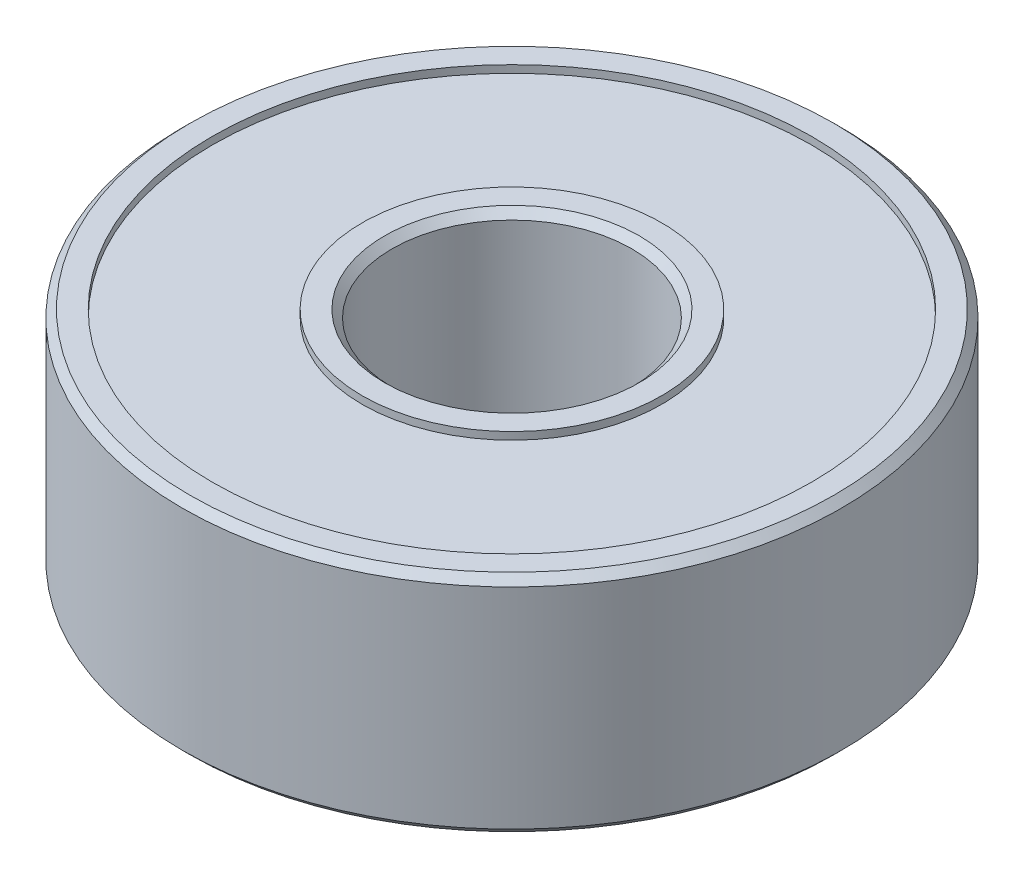
ISO-10303-21;
HEADER;
FILE_DESCRIPTION(('STEP AP214'),'2;1');
FILE_NAME('part.step','',(''),(''),'','','');
FILE_SCHEMA(('AUTOMOTIVE_DESIGN { 1 0 10303 214 1 1 1 1 }'));
ENDSEC;
DATA;
#1=APPLICATION_CONTEXT('core data for automotive mechanical design processes');
#2=APPLICATION_PROTOCOL_DEFINITION('international standard','automotive_design',2000,#1);
#3=PRODUCT_CONTEXT('',#1,'mechanical');
#4=PRODUCT('Part','Part','',(#3));
#5=PRODUCT_RELATED_PRODUCT_CATEGORY('part','',(#4));
#6=PRODUCT_DEFINITION_FORMATION('','',#4);
#7=PRODUCT_DEFINITION_CONTEXT('part definition',#1,'design');
#8=PRODUCT_DEFINITION('design','',#6,#7);
#9=PRODUCT_DEFINITION_SHAPE('','',#8);
#10=(LENGTH_UNIT() NAMED_UNIT(*) SI_UNIT(.MILLI.,.METRE.));
#11=(NAMED_UNIT(*) PLANE_ANGLE_UNIT() SI_UNIT($,.RADIAN.));
#12=(NAMED_UNIT(*) SI_UNIT($,.STERADIAN.) SOLID_ANGLE_UNIT());
#13=UNCERTAINTY_MEASURE_WITH_UNIT(LENGTH_MEASURE(1.E-05),#10,'distance_accuracy_value','');
#14=(GEOMETRIC_REPRESENTATION_CONTEXT(3) GLOBAL_UNCERTAINTY_ASSIGNED_CONTEXT((#13)) GLOBAL_UNIT_ASSIGNED_CONTEXT((#10,
#11,#12)) REPRESENTATION_CONTEXT('',''));
#15=CARTESIAN_POINT('',(0.,0.,0.));
#16=DIRECTION('',(0.,0.,1.));
#17=DIRECTION('',(1.,0.,0.));
#18=AXIS2_PLACEMENT_3D('',#15,#16,#17);
#19=CARTESIAN_POINT('',(0.,-3.5,0.));
#20=DIRECTION('',(0.,1.,0.));
#21=DIRECTION('',(0.,0.,1.));
#22=AXIS2_PLACEMENT_3D('',#19,#20,#21);
#23=CYLINDRICAL_SURFACE('',#22,5.);
#24=CARTESIAN_POINT('',(0.,-3.5,0.));
#25=DIRECTION('',(0.,1.,0.));
#26=DIRECTION('',(0.,0.,1.));
#27=AXIS2_PLACEMENT_3D('',#24,#25,#26);
#28=CIRCLE('',#27,5.);
#29=CARTESIAN_POINT('',(0.,-3.5,5.));
#30=VERTEX_POINT('',#29);
#31=EDGE_CURVE('E58',#30,#30,#28,.T.);
#32=ORIENTED_EDGE('',*,*,#31,.F.);
#33=EDGE_LOOP('',(#32));
#34=FACE_BOUND('',#33,.T.);
#35=CARTESIAN_POINT('',(0.,3.5,0.));
#36=DIRECTION('',(0.,1.,0.));
#37=DIRECTION('',(0.,0.,1.));
#38=AXIS2_PLACEMENT_3D('',#35,#36,#37);
#39=CIRCLE('',#38,5.);
#40=CARTESIAN_POINT('',(0.,3.5,5.));
#41=VERTEX_POINT('',#40);
#42=EDGE_CURVE('E66',#41,#41,#39,.T.);
#43=ORIENTED_EDGE('',*,*,#42,.T.);
#44=EDGE_LOOP('',(#43));
#45=FACE_BOUND('',#44,.T.);
#46=ADVANCED_FACE('F52',(#34,#45),#23,.F.);
#47=CARTESIAN_POINT('',(0.,-3.5,0.));
#48=DIRECTION('',(0.,1.,0.));
#49=DIRECTION('',(0.,0.,1.));
#50=AXIS2_PLACEMENT_3D('',#47,#48,#49);
#51=CYLINDRICAL_SURFACE('',#50,10.);
#52=CARTESIAN_POINT('',(0.,-3.5,0.));
#53=DIRECTION('',(0.,1.,0.));
#54=DIRECTION('',(0.,0.,1.));
#55=AXIS2_PLACEMENT_3D('',#52,#53,#54);
#56=CIRCLE('',#55,10.);
#57=CARTESIAN_POINT('',(0.,-3.5,10.));
#58=VERTEX_POINT('',#57);
#59=EDGE_CURVE('E12',#58,#58,#56,.T.);
#60=ORIENTED_EDGE('',*,*,#59,.T.);
#61=EDGE_LOOP('',(#60));
#62=FACE_BOUND('',#61,.T.);
#63=CARTESIAN_POINT('',(0.,3.5,0.));
#64=DIRECTION('',(0.,1.,0.));
#65=DIRECTION('',(0.,0.,1.));
#66=AXIS2_PLACEMENT_3D('',#63,#64,#65);
#67=CIRCLE('',#66,10.);
#68=CARTESIAN_POINT('',(0.,3.5,10.));
#69=VERTEX_POINT('',#68);
#70=EDGE_CURVE('E62',#69,#69,#67,.T.);
#71=ORIENTED_EDGE('',*,*,#70,.F.);
#72=EDGE_LOOP('',(#71));
#73=FACE_BOUND('',#72,.T.);
#74=ADVANCED_FACE('F80',(#62,#73),#51,.T.);
#75=CARTESIAN_POINT('',(-24.3414213562373,-3.5,0.));
#76=DIRECTION('',(0.,1.,0.));
#77=DIRECTION('',(0.,0.,1.));
#78=AXIS2_PLACEMENT_3D('',#75,#76,#77);
#79=PLANE('',#78);
#80=ORIENTED_EDGE('',*,*,#31,.T.);
#81=EDGE_LOOP('',(#80));
#82=FACE_BOUND('',#81,.T.);
#83=ORIENTED_EDGE('',*,*,#59,.F.);
#84=EDGE_LOOP('',(#83));
#85=FACE_BOUND('',#84,.T.);
#86=ADVANCED_FACE('F76',(#82,#85),#79,.F.);
#87=CARTESIAN_POINT('',(-24.3414213562373,3.5,0.));
#88=DIRECTION('',(0.,1.,0.));
#89=DIRECTION('',(0.,0.,1.));
#90=AXIS2_PLACEMENT_3D('',#87,#88,#89);
#91=PLANE('',#90);
#92=ORIENTED_EDGE('',*,*,#42,.F.);
#93=EDGE_LOOP('',(#92));
#94=FACE_BOUND('',#93,.T.);
#95=ORIENTED_EDGE('',*,*,#70,.T.);
#96=EDGE_LOOP('',(#95));
#97=FACE_BOUND('',#96,.T.);
#98=ADVANCED_FACE('F73',(#94,#97),#91,.T.);
#99=CLOSED_SHELL('',(#46,#74,#86,#98));
#100=MANIFOLD_SOLID_BREP('B2',#99);
#101=CARTESIAN_POINT('',(0.,-3.75,0.));
#102=DIRECTION('',(0.,1.,0.));
#103=DIRECTION('',(0.,0.,1.));
#104=AXIS2_PLACEMENT_3D('',#101,#102,#103);
#105=CYLINDRICAL_SURFACE('',#104,4.);
#106=CARTESIAN_POINT('',(0.,3.5,0.));
#107=DIRECTION('',(0.,1.,0.));
#108=DIRECTION('',(0.,0.,1.));
#109=AXIS2_PLACEMENT_3D('',#106,#107,#108);
#110=CIRCLE('',#109,4.);
#111=CARTESIAN_POINT('',(0.,3.5,4.));
#112=VERTEX_POINT('',#111);
#113=EDGE_CURVE('E132',#112,#112,#110,.T.);
#114=ORIENTED_EDGE('',*,*,#113,.T.);
#115=EDGE_LOOP('',(#114));
#116=FACE_BOUND('',#115,.T.);
#117=CARTESIAN_POINT('',(0.,-3.5,0.));
#118=DIRECTION('',(0.,1.,0.));
#119=DIRECTION('',(0.,0.,1.));
#120=AXIS2_PLACEMENT_3D('',#117,#118,#119);
#121=CIRCLE('',#120,4.);
#122=CARTESIAN_POINT('',(0.,-3.5,4.));
#123=VERTEX_POINT('',#122);
#124=EDGE_CURVE('E136',#123,#123,#121,.F.);
#125=ORIENTED_EDGE('',*,*,#124,.T.);
#126=EDGE_LOOP('',(#125));
#127=FACE_BOUND('',#126,.T.);
#128=ADVANCED_FACE('F121',(#116,#127),#105,.F.);
#129=CARTESIAN_POINT('',(0.,-3.75,0.));
#130=DIRECTION('',(0.,1.,0.));
#131=DIRECTION('',(0.,0.,1.));
#132=AXIS2_PLACEMENT_3D('',#129,#130,#131);
#133=CYLINDRICAL_SURFACE('',#132,5.);
#134=CARTESIAN_POINT('',(0.,-3.75,0.));
#135=DIRECTION('',(0.,1.,0.));
#136=DIRECTION('',(0.,0.,1.));
#137=AXIS2_PLACEMENT_3D('',#134,#135,#136);
#138=CIRCLE('',#137,5.);
#139=CARTESIAN_POINT('',(0.,-3.75,5.));
#140=VERTEX_POINT('',#139);
#141=EDGE_CURVE('E141',#140,#140,#138,.T.);
#142=ORIENTED_EDGE('',*,*,#141,.T.);
#143=EDGE_LOOP('',(#142));
#144=FACE_BOUND('',#143,.T.);
#145=CARTESIAN_POINT('',(0.,3.75,0.));
#146=DIRECTION('',(0.,1.,0.));
#147=DIRECTION('',(0.,0.,1.));
#148=AXIS2_PLACEMENT_3D('',#145,#146,#147);
#149=CIRCLE('',#148,5.);
#150=CARTESIAN_POINT('',(0.,3.75,5.));
#151=VERTEX_POINT('',#150);
#152=EDGE_CURVE('E144',#151,#151,#149,.T.);
#153=ORIENTED_EDGE('',*,*,#152,.F.);
#154=EDGE_LOOP('',(#153));
#155=FACE_BOUND('',#154,.T.);
#156=ADVANCED_FACE('F150',(#144,#155),#133,.T.);
#157=CARTESIAN_POINT('',(-24.3414213562373,-3.75,0.));
#158=DIRECTION('',(0.,1.,0.));
#159=DIRECTION('',(0.,0.,1.));
#160=AXIS2_PLACEMENT_3D('',#157,#158,#159);
#161=PLANE('',#160);
#162=CARTESIAN_POINT('',(0.,-3.75,0.));
#163=DIRECTION('',(0.,1.,0.));
#164=DIRECTION('',(0.,0.,1.));
#165=AXIS2_PLACEMENT_3D('',#162,#163,#164);
#166=CIRCLE('',#165,4.25);
#167=CARTESIAN_POINT('',(0.,-3.75,4.25));
#168=VERTEX_POINT('',#167);
#169=EDGE_CURVE('E51',#168,#168,#166,.T.);
#170=ORIENTED_EDGE('',*,*,#169,.T.);
#171=EDGE_LOOP('',(#170));
#172=FACE_BOUND('',#171,.T.);
#173=ORIENTED_EDGE('',*,*,#141,.F.);
#174=EDGE_LOOP('',(#173));
#175=FACE_BOUND('',#174,.T.);
#176=ADVANCED_FACE('F152',(#172,#175),#161,.F.);
#177=CARTESIAN_POINT('',(-24.3414213562373,3.75,0.));
#178=DIRECTION('',(0.,1.,0.));
#179=DIRECTION('',(0.,0.,1.));
#180=AXIS2_PLACEMENT_3D('',#177,#178,#179);
#181=PLANE('',#180);
#182=CARTESIAN_POINT('',(0.,3.75,0.));
#183=DIRECTION('',(0.,1.,0.));
#184=DIRECTION('',(0.,0.,1.));
#185=AXIS2_PLACEMENT_3D('',#182,#183,#184);
#186=CIRCLE('',#185,4.25);
#187=CARTESIAN_POINT('',(0.,3.75,4.25));
#188=VERTEX_POINT('',#187);
#189=EDGE_CURVE('E128',#188,#188,#186,.F.);
#190=ORIENTED_EDGE('',*,*,#189,.T.);
#191=EDGE_LOOP('',(#190));
#192=FACE_BOUND('',#191,.T.);
#193=ORIENTED_EDGE('',*,*,#152,.T.);
#194=EDGE_LOOP('',(#193));
#195=FACE_BOUND('',#194,.T.);
#196=ADVANCED_FACE('F148',(#192,#195),#181,.T.);
#197=CARTESIAN_POINT('',(0.,3.5,0.));
#198=DIRECTION('',(0.,1.,0.));
#199=DIRECTION('',(0.,0.,1.));
#200=AXIS2_PLACEMENT_3D('',#197,#198,#199);
#201=CONICAL_SURFACE('',#200,4.,0.785398163397452);
#202=ORIENTED_EDGE('',*,*,#189,.F.);
#203=EDGE_LOOP('',(#202));
#204=FACE_BOUND('',#203,.T.);
#205=ORIENTED_EDGE('',*,*,#113,.F.);
#206=EDGE_LOOP('',(#205));
#207=FACE_BOUND('',#206,.T.);
#208=ADVANCED_FACE('F163',(#204,#207),#201,.F.);
#209=CARTESIAN_POINT('',(0.,-3.75,0.));
#210=DIRECTION('',(0.,-1.,0.));
#211=DIRECTION('',(0.,0.,-1.));
#212=AXIS2_PLACEMENT_3D('',#209,#210,#211);
#213=CONICAL_SURFACE('',#212,4.25,0.785398163397447);
#214=ORIENTED_EDGE('',*,*,#124,.F.);
#215=EDGE_LOOP('',(#214));
#216=FACE_BOUND('',#215,.T.);
#217=ORIENTED_EDGE('',*,*,#169,.F.);
#218=EDGE_LOOP('',(#217));
#219=FACE_BOUND('',#218,.T.);
#220=ADVANCED_FACE('F123',(#216,#219),#213,.F.);
#221=CLOSED_SHELL('',(#128,#156,#176,#196,#208,#220));
#222=MANIFOLD_SOLID_BREP('B7',#221);
#223=CARTESIAN_POINT('',(0.,-3.75,0.));
#224=DIRECTION('',(0.,1.,0.));
#225=DIRECTION('',(0.,0.,1.));
#226=AXIS2_PLACEMENT_3D('',#223,#224,#225);
#227=CYLINDRICAL_SURFACE('',#226,10.);
#228=CARTESIAN_POINT('',(0.,-3.75,0.));
#229=DIRECTION('',(0.,1.,0.));
#230=DIRECTION('',(0.,0.,1.));
#231=AXIS2_PLACEMENT_3D('',#228,#229,#230);
#232=CIRCLE('',#231,10.);
#233=CARTESIAN_POINT('',(0.,-3.75,10.));
#234=VERTEX_POINT('',#233);
#235=EDGE_CURVE('E233',#234,#234,#232,.T.);
#236=ORIENTED_EDGE('',*,*,#235,.F.);
#237=EDGE_LOOP('',(#236));
#238=FACE_BOUND('',#237,.T.);
#239=CARTESIAN_POINT('',(0.,3.75,0.));
#240=DIRECTION('',(0.,1.,0.));
#241=DIRECTION('',(0.,0.,1.));
#242=AXIS2_PLACEMENT_3D('',#239,#240,#241);
#243=CIRCLE('',#242,10.);
#244=CARTESIAN_POINT('',(0.,3.75,10.));
#245=VERTEX_POINT('',#244);
#246=EDGE_CURVE('E236',#245,#245,#243,.T.);
#247=ORIENTED_EDGE('',*,*,#246,.T.);
#248=EDGE_LOOP('',(#247));
#249=FACE_BOUND('',#248,.T.);
#250=ADVANCED_FACE('F213',(#238,#249),#227,.F.);
#251=CARTESIAN_POINT('',(0.,-3.75,0.));
#252=DIRECTION('',(0.,1.,0.));
#253=DIRECTION('',(0.,0.,1.));
#254=AXIS2_PLACEMENT_3D('',#251,#252,#253);
#255=CYLINDRICAL_SURFACE('',#254,11.);
#256=CARTESIAN_POINT('',(0.,-3.5,0.));
#257=DIRECTION('',(0.,1.,0.));
#258=DIRECTION('',(0.,0.,1.));
#259=AXIS2_PLACEMENT_3D('',#256,#257,#258);
#260=CIRCLE('',#259,11.);
#261=CARTESIAN_POINT('',(0.,-3.5,11.));
#262=VERTEX_POINT('',#261);
#263=EDGE_CURVE('E220',#262,#262,#260,.T.);
#264=ORIENTED_EDGE('',*,*,#263,.T.);
#265=EDGE_LOOP('',(#264));
#266=FACE_BOUND('',#265,.T.);
#267=CARTESIAN_POINT('',(0.,3.5,0.));
#268=DIRECTION('',(0.,1.,0.));
#269=DIRECTION('',(0.,0.,1.));
#270=AXIS2_PLACEMENT_3D('',#267,#268,#269);
#271=CIRCLE('',#270,11.);
#272=CARTESIAN_POINT('',(0.,3.5,11.));
#273=VERTEX_POINT('',#272);
#274=EDGE_CURVE('E224',#273,#273,#271,.F.);
#275=ORIENTED_EDGE('',*,*,#274,.T.);
#276=EDGE_LOOP('',(#275));
#277=FACE_BOUND('',#276,.T.);
#278=ADVANCED_FACE('F252',(#266,#277),#255,.T.);
#279=CARTESIAN_POINT('',(-24.3414213562373,-3.75,0.));
#280=DIRECTION('',(0.,1.,0.));
#281=DIRECTION('',(0.,0.,1.));
#282=AXIS2_PLACEMENT_3D('',#279,#280,#281);
#283=PLANE('',#282);
#284=CARTESIAN_POINT('',(0.,-3.75,0.));
#285=DIRECTION('',(0.,1.,0.));
#286=DIRECTION('',(0.,0.,1.));
#287=AXIS2_PLACEMENT_3D('',#284,#285,#286);
#288=CIRCLE('',#287,10.75);
#289=CARTESIAN_POINT('',(0.,-3.75,10.75));
#290=VERTEX_POINT('',#289);
#291=EDGE_CURVE('E120',#290,#290,#288,.F.);
#292=ORIENTED_EDGE('',*,*,#291,.T.);
#293=EDGE_LOOP('',(#292));
#294=FACE_BOUND('',#293,.T.);
#295=ORIENTED_EDGE('',*,*,#235,.T.);
#296=EDGE_LOOP('',(#295));
#297=FACE_BOUND('',#296,.T.);
#298=ADVANCED_FACE('F244',(#294,#297),#283,.F.);
#299=CARTESIAN_POINT('',(-24.3414213562373,3.75,0.));
#300=DIRECTION('',(0.,1.,0.));
#301=DIRECTION('',(0.,0.,1.));
#302=AXIS2_PLACEMENT_3D('',#299,#300,#301);
#303=PLANE('',#302);
#304=CARTESIAN_POINT('',(0.,3.75,0.));
#305=DIRECTION('',(0.,1.,0.));
#306=DIRECTION('',(0.,0.,1.));
#307=AXIS2_PLACEMENT_3D('',#304,#305,#306);
#308=CIRCLE('',#307,10.75);
#309=CARTESIAN_POINT('',(0.,3.75,10.75));
#310=VERTEX_POINT('',#309);
#311=EDGE_CURVE('E228',#310,#310,#308,.T.);
#312=ORIENTED_EDGE('',*,*,#311,.T.);
#313=EDGE_LOOP('',(#312));
#314=FACE_BOUND('',#313,.T.);
#315=ORIENTED_EDGE('',*,*,#246,.F.);
#316=EDGE_LOOP('',(#315));
#317=FACE_BOUND('',#316,.T.);
#318=ADVANCED_FACE('F241',(#314,#317),#303,.T.);
#319=CARTESIAN_POINT('',(0.,3.75,0.));
#320=DIRECTION('',(0.,-1.,0.));
#321=DIRECTION('',(0.,0.,-1.));
#322=AXIS2_PLACEMENT_3D('',#319,#320,#321);
#323=CONICAL_SURFACE('',#322,10.75,0.785398163397455);
#324=ORIENTED_EDGE('',*,*,#274,.F.);
#325=EDGE_LOOP('',(#324));
#326=FACE_BOUND('',#325,.T.);
#327=ORIENTED_EDGE('',*,*,#311,.F.);
#328=EDGE_LOOP('',(#327));
#329=FACE_BOUND('',#328,.T.);
#330=ADVANCED_FACE('F243',(#326,#329),#323,.T.);
#331=CARTESIAN_POINT('',(0.,-3.5,0.));
#332=DIRECTION('',(0.,1.,0.));
#333=DIRECTION('',(0.,0.,1.));
#334=AXIS2_PLACEMENT_3D('',#331,#332,#333);
#335=CONICAL_SURFACE('',#334,11.,0.785398163397448);
#336=ORIENTED_EDGE('',*,*,#291,.F.);
#337=EDGE_LOOP('',(#336));
#338=FACE_BOUND('',#337,.T.);
#339=ORIENTED_EDGE('',*,*,#263,.F.);
#340=EDGE_LOOP('',(#339));
#341=FACE_BOUND('',#340,.T.);
#342=ADVANCED_FACE('F215',(#338,#341),#335,.T.);
#343=CLOSED_SHELL('',(#250,#278,#298,#318,#330,#342));
#344=MANIFOLD_SOLID_BREP('B46',#343);
#345=ADVANCED_BREP_SHAPE_REPRESENTATION('',(#18,#100,#222,#344),#14);
#346=SHAPE_DEFINITION_REPRESENTATION(#9,#345);
ENDSEC;
END-ISO-10303-21;
